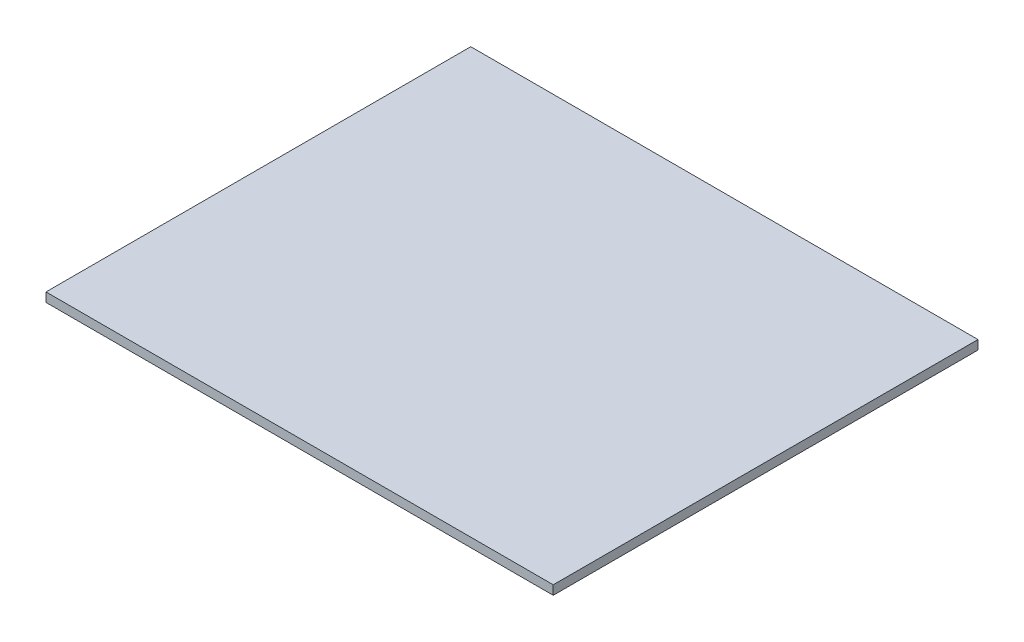
ISO-10303-21;
HEADER;
FILE_DESCRIPTION(('STEP AP214'),'2;1');
FILE_NAME('part.step','',(''),(''),'','','');
FILE_SCHEMA(('AUTOMOTIVE_DESIGN { 1 0 10303 214 1 1 1 1 }'));
ENDSEC;
DATA;
#1=APPLICATION_CONTEXT('core data for automotive mechanical design processes');
#2=APPLICATION_PROTOCOL_DEFINITION('international standard','automotive_design',2000,#1);
#3=PRODUCT_CONTEXT('',#1,'mechanical');
#4=PRODUCT('Part','Part','',(#3));
#5=PRODUCT_RELATED_PRODUCT_CATEGORY('part','',(#4));
#6=PRODUCT_DEFINITION_FORMATION('','',#4);
#7=PRODUCT_DEFINITION_CONTEXT('part definition',#1,'design');
#8=PRODUCT_DEFINITION('design','',#6,#7);
#9=PRODUCT_DEFINITION_SHAPE('','',#8);
#10=(LENGTH_UNIT() NAMED_UNIT(*) SI_UNIT(.MILLI.,.METRE.));
#11=(NAMED_UNIT(*) PLANE_ANGLE_UNIT() SI_UNIT($,.RADIAN.));
#12=(NAMED_UNIT(*) SI_UNIT($,.STERADIAN.) SOLID_ANGLE_UNIT());
#13=UNCERTAINTY_MEASURE_WITH_UNIT(LENGTH_MEASURE(1.E-05),#10,'distance_accuracy_value','');
#14=(GEOMETRIC_REPRESENTATION_CONTEXT(3) GLOBAL_UNCERTAINTY_ASSIGNED_CONTEXT((#13)) GLOBAL_UNIT_ASSIGNED_CONTEXT((#10,
#11,#12)) REPRESENTATION_CONTEXT('',''));
#15=CARTESIAN_POINT('',(0.,0.,0.));
#16=DIRECTION('',(0.,0.,1.));
#17=DIRECTION('',(1.,0.,0.));
#18=AXIS2_PLACEMENT_3D('',#15,#16,#17);
#19=CARTESIAN_POINT('',(0.,2.,0.));
#20=DIRECTION('',(1.,0.,0.));
#21=DIRECTION('',(0.,0.,-1.));
#22=AXIS2_PLACEMENT_3D('',#19,#20,#21);
#23=PLANE('',#22);
#24=DIRECTION('',(0.,0.,1.));
#25=VECTOR('',#24,1.);
#26=CARTESIAN_POINT('',(0.,0.,0.));
#27=LINE('',#26,#25);
#28=CARTESIAN_POINT('',(0.,0.,-93.0339225997375));
#29=VERTEX_POINT('',#28);
#30=CARTESIAN_POINT('',(0.,0.,0.));
#31=VERTEX_POINT('',#30);
#32=EDGE_CURVE('E96',#29,#31,#27,.T.);
#33=ORIENTED_EDGE('',*,*,#32,.T.);
#34=DIRECTION('',(0.,-1.,0.));
#35=VECTOR('',#34,1.);
#36=CARTESIAN_POINT('',(0.,2.,0.));
#37=LINE('',#36,#35);
#38=CARTESIAN_POINT('',(0.,2.,0.));
#39=VERTEX_POINT('',#38);
#40=EDGE_CURVE('E11',#39,#31,#37,.T.);
#41=ORIENTED_EDGE('',*,*,#40,.F.);
#42=DIRECTION('',(0.,0.,1.));
#43=VECTOR('',#42,1.);
#44=CARTESIAN_POINT('',(0.,2.,0.));
#45=LINE('',#44,#43);
#46=CARTESIAN_POINT('',(0.,2.,-93.0339225997375));
#47=VERTEX_POINT('',#46);
#48=EDGE_CURVE('E84',#47,#39,#45,.T.);
#49=ORIENTED_EDGE('',*,*,#48,.F.);
#50=DIRECTION('',(0.,-1.,0.));
#51=VECTOR('',#50,1.);
#52=CARTESIAN_POINT('',(0.,2.,-93.0339225997375));
#53=LINE('',#52,#51);
#54=EDGE_CURVE('E92',#47,#29,#53,.T.);
#55=ORIENTED_EDGE('',*,*,#54,.T.);
#56=EDGE_LOOP('',(#33,#41,#49,#55));
#57=FACE_BOUND('',#56,.T.);
#58=ADVANCED_FACE('F33',(#57),#23,.F.);
#59=CARTESIAN_POINT('',(0.,2.,0.));
#60=DIRECTION('',(0.,0.,-1.));
#61=DIRECTION('',(-1.,0.,0.));
#62=AXIS2_PLACEMENT_3D('',#59,#60,#61);
#63=PLANE('',#62);
#64=DIRECTION('',(1.,0.,0.));
#65=VECTOR('',#64,1.);
#66=CARTESIAN_POINT('',(0.,0.,0.));
#67=LINE('',#66,#65);
#68=CARTESIAN_POINT('',(111.098761939492,0.,0.));
#69=VERTEX_POINT('',#68);
#70=EDGE_CURVE('E88',#31,#69,#67,.T.);
#71=ORIENTED_EDGE('',*,*,#70,.T.);
#72=DIRECTION('',(0.,-1.,0.));
#73=VECTOR('',#72,1.);
#74=CARTESIAN_POINT('',(111.098761939492,2.,0.));
#75=LINE('',#74,#73);
#76=CARTESIAN_POINT('',(111.098761939492,2.,0.));
#77=VERTEX_POINT('',#76);
#78=EDGE_CURVE('E41',#77,#69,#75,.T.);
#79=ORIENTED_EDGE('',*,*,#78,.F.);
#80=DIRECTION('',(1.,0.,0.));
#81=VECTOR('',#80,1.);
#82=CARTESIAN_POINT('',(0.,2.,0.));
#83=LINE('',#82,#81);
#84=EDGE_CURVE('E79',#39,#77,#83,.T.);
#85=ORIENTED_EDGE('',*,*,#84,.F.);
#86=ORIENTED_EDGE('',*,*,#40,.T.);
#87=EDGE_LOOP('',(#71,#79,#85,#86));
#88=FACE_BOUND('',#87,.T.);
#89=ADVANCED_FACE('F87',(#88),#63,.F.);
#90=CARTESIAN_POINT('',(111.098761939492,2.,0.));
#91=DIRECTION('',(-1.,0.,0.));
#92=DIRECTION('',(0.,0.,1.));
#93=AXIS2_PLACEMENT_3D('',#90,#91,#92);
#94=PLANE('',#93);
#95=DIRECTION('',(0.,0.,-1.));
#96=VECTOR('',#95,1.);
#97=CARTESIAN_POINT('',(111.098761939492,0.,0.));
#98=LINE('',#97,#96);
#99=CARTESIAN_POINT('',(111.098761939492,0.,-93.0339225997375));
#100=VERTEX_POINT('',#99);
#101=EDGE_CURVE('E66',#69,#100,#98,.T.);
#102=ORIENTED_EDGE('',*,*,#101,.T.);
#103=DIRECTION('',(0.,-1.,0.));
#104=VECTOR('',#103,1.);
#105=CARTESIAN_POINT('',(111.098761939492,2.,-93.0339225997375));
#106=LINE('',#105,#104);
#107=CARTESIAN_POINT('',(111.098761939492,2.,-93.0339225997375));
#108=VERTEX_POINT('',#107);
#109=EDGE_CURVE('E89',#108,#100,#106,.T.);
#110=ORIENTED_EDGE('',*,*,#109,.F.);
#111=DIRECTION('',(0.,0.,-1.));
#112=VECTOR('',#111,1.);
#113=CARTESIAN_POINT('',(111.098761939492,2.,0.));
#114=LINE('',#113,#112);
#115=EDGE_CURVE('E82',#77,#108,#114,.T.);
#116=ORIENTED_EDGE('',*,*,#115,.F.);
#117=ORIENTED_EDGE('',*,*,#78,.T.);
#118=EDGE_LOOP('',(#102,#110,#116,#117));
#119=FACE_BOUND('',#118,.T.);
#120=ADVANCED_FACE('F90',(#119),#94,.F.);
#121=CARTESIAN_POINT('',(0.,2.,-93.0339225997375));
#122=DIRECTION('',(0.,0.,1.));
#123=DIRECTION('',(1.,0.,0.));
#124=AXIS2_PLACEMENT_3D('',#121,#122,#123);
#125=PLANE('',#124);
#126=DIRECTION('',(-1.,0.,0.));
#127=VECTOR('',#126,1.);
#128=CARTESIAN_POINT('',(0.,0.,-93.0339225997375));
#129=LINE('',#128,#127);
#130=EDGE_CURVE('E72',#100,#29,#129,.T.);
#131=ORIENTED_EDGE('',*,*,#130,.T.);
#132=ORIENTED_EDGE('',*,*,#54,.F.);
#133=DIRECTION('',(-1.,0.,0.));
#134=VECTOR('',#133,1.);
#135=CARTESIAN_POINT('',(0.,2.,-93.0339225997375));
#136=LINE('',#135,#134);
#137=EDGE_CURVE('E49',#108,#47,#136,.T.);
#138=ORIENTED_EDGE('',*,*,#137,.F.);
#139=ORIENTED_EDGE('',*,*,#109,.T.);
#140=EDGE_LOOP('',(#131,#132,#138,#139));
#141=FACE_BOUND('',#140,.T.);
#142=ADVANCED_FACE('F103',(#141),#125,.F.);
#143=CARTESIAN_POINT('',(0.,2.,0.));
#144=DIRECTION('',(0.,-1.,0.));
#145=DIRECTION('',(0.,0.,-1.));
#146=AXIS2_PLACEMENT_3D('',#143,#144,#145);
#147=PLANE('',#146);
#148=ORIENTED_EDGE('',*,*,#48,.T.);
#149=ORIENTED_EDGE('',*,*,#84,.T.);
#150=ORIENTED_EDGE('',*,*,#115,.T.);
#151=ORIENTED_EDGE('',*,*,#137,.T.);
#152=EDGE_LOOP('',(#148,#149,#150,#151));
#153=FACE_BOUND('',#152,.T.);
#154=ADVANCED_FACE('F80',(#153),#147,.F.);
#155=CARTESIAN_POINT('',(0.,0.,0.));
#156=DIRECTION('',(0.,-1.,0.));
#157=DIRECTION('',(0.,0.,-1.));
#158=AXIS2_PLACEMENT_3D('',#155,#156,#157);
#159=PLANE('',#158);
#160=ORIENTED_EDGE('',*,*,#32,.F.);
#161=ORIENTED_EDGE('',*,*,#130,.F.);
#162=ORIENTED_EDGE('',*,*,#101,.F.);
#163=ORIENTED_EDGE('',*,*,#70,.F.);
#164=EDGE_LOOP('',(#160,#161,#162,#163));
#165=FACE_BOUND('',#164,.T.);
#166=ADVANCED_FACE('F106',(#165),#159,.T.);
#167=CLOSED_SHELL('',(#58,#89,#120,#142,#154,#166));
#168=MANIFOLD_SOLID_BREP('B2',#167);
#169=ADVANCED_BREP_SHAPE_REPRESENTATION('',(#18,#168),#14);
#170=SHAPE_DEFINITION_REPRESENTATION(#9,#169);
ENDSEC;
END-ISO-10303-21;
